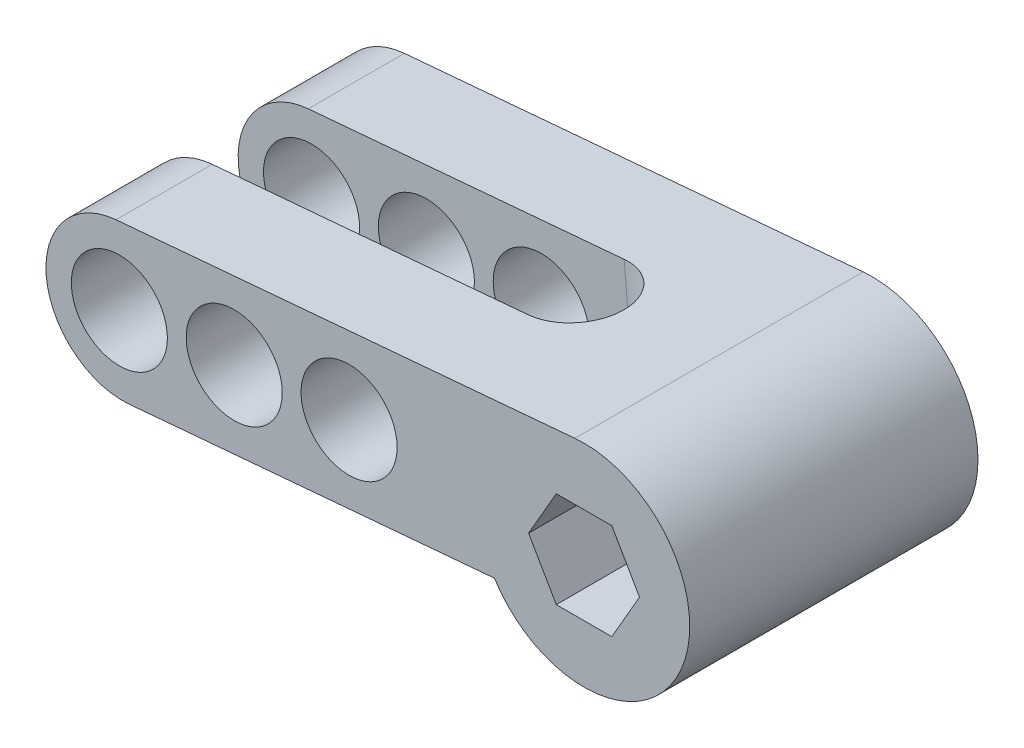
ISO-10303-21;
HEADER;
FILE_DESCRIPTION(('STEP AP214'),'2;1');
FILE_NAME('part.step','',(''),(''),'','','');
FILE_SCHEMA(('AUTOMOTIVE_DESIGN { 1 0 10303 214 1 1 1 1 }'));
ENDSEC;
DATA;
#1=APPLICATION_CONTEXT('core data for automotive mechanical design processes');
#2=APPLICATION_PROTOCOL_DEFINITION('international standard','automotive_design',2000,#1);
#3=PRODUCT_CONTEXT('',#1,'mechanical');
#4=PRODUCT('Part','Part','',(#3));
#5=PRODUCT_RELATED_PRODUCT_CATEGORY('part','',(#4));
#6=PRODUCT_DEFINITION_FORMATION('','',#4);
#7=PRODUCT_DEFINITION_CONTEXT('part definition',#1,'design');
#8=PRODUCT_DEFINITION('design','',#6,#7);
#9=PRODUCT_DEFINITION_SHAPE('','',#8);
#10=(LENGTH_UNIT() NAMED_UNIT(*) SI_UNIT(.MILLI.,.METRE.));
#11=(NAMED_UNIT(*) PLANE_ANGLE_UNIT() SI_UNIT($,.RADIAN.));
#12=(NAMED_UNIT(*) SI_UNIT($,.STERADIAN.) SOLID_ANGLE_UNIT());
#13=UNCERTAINTY_MEASURE_WITH_UNIT(LENGTH_MEASURE(1.E-05),#10,'distance_accuracy_value','');
#14=(GEOMETRIC_REPRESENTATION_CONTEXT(3) GLOBAL_UNCERTAINTY_ASSIGNED_CONTEXT((#13)) GLOBAL_UNIT_ASSIGNED_CONTEXT((#10,
#11,#12)) REPRESENTATION_CONTEXT('',''));
#15=CARTESIAN_POINT('',(0.,0.,0.));
#16=DIRECTION('',(0.,0.,1.));
#17=DIRECTION('',(1.,0.,0.));
#18=AXIS2_PLACEMENT_3D('',#15,#16,#17);
#19=CARTESIAN_POINT('',(-23.8813367654225,-0.985663432292144,30.));
#20=DIRECTION('',(0.,0.,-1.));
#21=DIRECTION('',(-1.,0.,0.));
#22=AXIS2_PLACEMENT_3D('',#19,#20,#21);
#23=CYLINDRICAL_SURFACE('',#22,8.00000000000002);
#24=DIRECTION('',(0.,0.,-1.));
#25=VECTOR('',#24,1.);
#26=CARTESIAN_POINT('',(-23.1840908234413,-8.95522101702613,30.));
#27=LINE('',#26,#25);
#28=CARTESIAN_POINT('',(-23.1840908234413,-8.95522101702612,10.));
#29=VERTEX_POINT('',#28);
#30=CARTESIAN_POINT('',(-23.1840908234413,-8.95522101702613,0.));
#31=VERTEX_POINT('',#30);
#32=EDGE_CURVE('E232',#29,#31,#27,.T.);
#33=ORIENTED_EDGE('',*,*,#32,.F.);
#34=CARTESIAN_POINT('',(-23.8813367654225,-0.985663432292144,10.));
#35=DIRECTION('',(0.,0.,-1.));
#36=DIRECTION('',(-1.,0.,0.));
#37=AXIS2_PLACEMENT_3D('',#34,#35,#36);
#38=CIRCLE('',#37,8.00000000000002);
#39=CARTESIAN_POINT('',(-24.5785827074038,6.98389415244186,10.));
#40=VERTEX_POINT('',#39);
#41=EDGE_CURVE('E163',#29,#40,#38,.T.);
#42=ORIENTED_EDGE('',*,*,#41,.T.);
#43=DIRECTION('',(0.,0.,-1.));
#44=VECTOR('',#43,1.);
#45=CARTESIAN_POINT('',(-24.5785827074038,6.98389415244185,30.));
#46=LINE('',#45,#44);
#47=CARTESIAN_POINT('',(-24.5785827074038,6.98389415244185,0.));
#48=VERTEX_POINT('',#47);
#49=EDGE_CURVE('E236',#40,#48,#46,.T.);
#50=ORIENTED_EDGE('',*,*,#49,.T.);
#51=CARTESIAN_POINT('',(-23.8813367654225,-0.985663432292144,0.));
#52=DIRECTION('',(0.,0.,1.));
#53=DIRECTION('',(1.,0.,0.));
#54=AXIS2_PLACEMENT_3D('',#51,#52,#53);
#55=CIRCLE('',#54,8.00000000000002);
#56=EDGE_CURVE('E226',#48,#31,#55,.T.);
#57=ORIENTED_EDGE('',*,*,#56,.T.);
#58=EDGE_LOOP('',(#33,#42,#50,#57));
#59=FACE_BOUND('',#58,.T.);
#60=ADVANCED_FACE('F33',(#59),#23,.T.);
#61=CARTESIAN_POINT('',(24.1186632345775,0.202332904322172,30.));
#62=DIRECTION('',(0.,0.,1.));
#63=DIRECTION('',(1.,0.,0.));
#64=AXIS2_PLACEMENT_3D('',#61,#62,#63);
#65=PLANE('',#64);
#66=CARTESIAN_POINT('',(-0.334853870139772,1.07438688695221,30.));
#67=DIRECTION('',(0.,0.,1.));
#68=DIRECTION('',(1.,0.,0.));
#69=AXIS2_PLACEMENT_3D('',#66,#67,#68);
#70=CIRCLE('',#69,5.);
#71=CARTESIAN_POINT('',(4.66514612986023,1.07438688695221,30.));
#72=VERTEX_POINT('',#71);
#73=EDGE_CURVE('E373',#72,#72,#70,.T.);
#74=ORIENTED_EDGE('',*,*,#73,.F.);
#75=EDGE_LOOP('',(#74));
#76=FACE_BOUND('',#75,.T.);
#77=CARTESIAN_POINT('',(-12.2891902472407,0.0285179739803122,30.));
#78=DIRECTION('',(0.,0.,1.));
#79=DIRECTION('',(1.,0.,0.));
#80=AXIS2_PLACEMENT_3D('',#77,#78,#79);
#81=CIRCLE('',#80,5.);
#82=CARTESIAN_POINT('',(-7.28919024724072,0.0285179739803122,30.));
#83=VERTEX_POINT('',#82);
#84=EDGE_CURVE('E258',#83,#83,#81,.T.);
#85=ORIENTED_EDGE('',*,*,#84,.F.);
#86=EDGE_LOOP('',(#85));
#87=FACE_BOUND('',#86,.T.);
#88=CARTESIAN_POINT('',(-24.2435266243417,-1.01735093899159,30.));
#89=DIRECTION('',(0.,0.,1.));
#90=DIRECTION('',(1.,0.,0.));
#91=AXIS2_PLACEMENT_3D('',#88,#89,#90);
#92=CIRCLE('',#91,5.);
#93=CARTESIAN_POINT('',(-19.2435266243417,-1.01735093899159,30.));
#94=VERTEX_POINT('',#93);
#95=EDGE_CURVE('E255',#94,#94,#92,.T.);
#96=ORIENTED_EDGE('',*,*,#95,.F.);
#97=EDGE_LOOP('',(#96));
#98=FACE_BOUND('',#97,.T.);
#99=CARTESIAN_POINT('',(24.1186632345775,0.202332904322172,30.));
#100=DIRECTION('',(0.,0.,1.));
#101=DIRECTION('',(1.,0.,0.));
#102=AXIS2_PLACEMENT_3D('',#99,#100,#101);
#103=CIRCLE('',#102,11.);
#104=CARTESIAN_POINT('',(14.7937671691529,-5.6325889776767,30.));
#105=VERTEX_POINT('',#104);
#106=CARTESIAN_POINT('',(23.1599500643533,11.1604745833314,30.));
#107=VERTEX_POINT('',#106);
#108=EDGE_CURVE('E210',#105,#107,#103,.T.);
#109=ORIENTED_EDGE('',*,*,#108,.T.);
#110=DIRECTION('',(-0.996194698091746,-0.0871557427476584,0.));
#111=VECTOR('',#110,1.);
#112=CARTESIAN_POINT('',(23.1599500643533,11.1604745833314,30.));
#113=LINE('',#112,#111);
#114=CARTESIAN_POINT('',(-24.5785827074038,6.98389415244185,30.));
#115=VERTEX_POINT('',#114);
#116=EDGE_CURVE('E213',#107,#115,#113,.T.);
#117=ORIENTED_EDGE('',*,*,#116,.T.);
#118=CARTESIAN_POINT('',(-23.8813367654225,-0.985663432292144,30.));
#119=DIRECTION('',(0.,0.,1.));
#120=DIRECTION('',(1.,0.,0.));
#121=AXIS2_PLACEMENT_3D('',#118,#119,#120);
#122=CIRCLE('',#121,8.00000000000002);
#123=CARTESIAN_POINT('',(-23.1840908234413,-8.95522101702613,30.));
#124=VERTEX_POINT('',#123);
#125=EDGE_CURVE('E216',#115,#124,#122,.T.);
#126=ORIENTED_EDGE('',*,*,#125,.T.);
#127=DIRECTION('',(0.996194698091746,0.0871557427476587,0.));
#128=VECTOR('',#127,1.);
#129=CARTESIAN_POINT('',(-23.1840908234412,-8.95522101702612,30.));
#130=LINE('',#129,#128);
#131=EDGE_CURVE('E218',#124,#105,#130,.T.);
#132=ORIENTED_EDGE('',*,*,#131,.T.);
#133=EDGE_LOOP('',(#109,#117,#126,#132));
#134=FACE_BOUND('',#133,.T.);
#135=DIRECTION('',(0.500000000000001,0.866025403784438,0.));
#136=VECTOR('',#135,1.);
#137=CARTESIAN_POINT('',(27.0054145805257,-4.79766709567789,30.));
#138=LINE('',#137,#136);
#139=CARTESIAN_POINT('',(27.0054145805257,-4.79766709567789,30.));
#140=VERTEX_POINT('',#139);
#141=CARTESIAN_POINT('',(29.8921659264738,0.202332904322144,30.));
#142=VERTEX_POINT('',#141);
#143=EDGE_CURVE('E169',#140,#142,#138,.T.);
#144=ORIENTED_EDGE('',*,*,#143,.F.);
#145=DIRECTION('',(1.,0.,0.));
#146=VECTOR('',#145,1.);
#147=CARTESIAN_POINT('',(21.2319118886294,-4.79766709567789,30.));
#148=LINE('',#147,#146);
#149=CARTESIAN_POINT('',(21.2319118886294,-4.79766709567789,30.));
#150=VERTEX_POINT('',#149);
#151=EDGE_CURVE('E167',#150,#140,#148,.T.);
#152=ORIENTED_EDGE('',*,*,#151,.F.);
#153=DIRECTION('',(0.500000000000001,-0.866025403784438,0.));
#154=VECTOR('',#153,1.);
#155=CARTESIAN_POINT('',(18.3451605426812,0.202332904322144,30.));
#156=LINE('',#155,#154);
#157=CARTESIAN_POINT('',(18.3451605426812,0.202332904322145,30.));
#158=VERTEX_POINT('',#157);
#159=EDGE_CURVE('E178',#158,#150,#156,.T.);
#160=ORIENTED_EDGE('',*,*,#159,.F.);
#161=DIRECTION('',(-0.499999999999999,-0.866025403784439,0.));
#162=VECTOR('',#161,1.);
#163=CARTESIAN_POINT('',(21.2319118886294,5.2023329043222,30.));
#164=LINE('',#163,#162);
#165=CARTESIAN_POINT('',(21.2319118886294,5.2023329043222,30.));
#166=VERTEX_POINT('',#165);
#167=EDGE_CURVE('E176',#166,#158,#164,.T.);
#168=ORIENTED_EDGE('',*,*,#167,.F.);
#169=DIRECTION('',(-1.,0.,0.));
#170=VECTOR('',#169,1.);
#171=CARTESIAN_POINT('',(27.0054145805257,5.2023329043222,30.));
#172=LINE('',#171,#170);
#173=CARTESIAN_POINT('',(27.0054145805257,5.2023329043222,30.));
#174=VERTEX_POINT('',#173);
#175=EDGE_CURVE('E174',#174,#166,#172,.T.);
#176=ORIENTED_EDGE('',*,*,#175,.F.);
#177=DIRECTION('',(-0.5,0.866025403784438,0.));
#178=VECTOR('',#177,1.);
#179=CARTESIAN_POINT('',(29.8921659264738,0.202332904322144,30.));
#180=LINE('',#179,#178);
#181=EDGE_CURVE('E172',#142,#174,#180,.T.);
#182=ORIENTED_EDGE('',*,*,#181,.F.);
#183=EDGE_LOOP('',(#144,#152,#160,#168,#176,#182));
#184=FACE_BOUND('',#183,.T.);
#185=ADVANCED_FACE('F294',(#76,#87,#98,#134,#184),#65,.T.);
#186=CARTESIAN_POINT('',(24.1186632345775,0.202332904322172,0.));
#187=DIRECTION('',(0.,0.,1.));
#188=DIRECTION('',(1.,0.,0.));
#189=AXIS2_PLACEMENT_3D('',#186,#187,#188);
#190=PLANE('',#189);
#191=CARTESIAN_POINT('',(-0.334853870139772,1.07438688695221,0.));
#192=DIRECTION('',(0.,0.,1.));
#193=DIRECTION('',(1.,0.,0.));
#194=AXIS2_PLACEMENT_3D('',#191,#192,#193);
#195=CIRCLE('',#194,5.);
#196=CARTESIAN_POINT('',(4.66514612986023,1.07438688695221,0.));
#197=VERTEX_POINT('',#196);
#198=EDGE_CURVE('E370',#197,#197,#195,.T.);
#199=ORIENTED_EDGE('',*,*,#198,.T.);
#200=EDGE_LOOP('',(#199));
#201=FACE_BOUND('',#200,.T.);
#202=CARTESIAN_POINT('',(-12.2891902472407,0.0285179739803122,0.));
#203=DIRECTION('',(0.,0.,1.));
#204=DIRECTION('',(1.,0.,0.));
#205=AXIS2_PLACEMENT_3D('',#202,#203,#204);
#206=CIRCLE('',#205,5.);
#207=CARTESIAN_POINT('',(-7.28919024724072,0.0285179739803122,0.));
#208=VERTEX_POINT('',#207);
#209=EDGE_CURVE('E251',#208,#208,#206,.T.);
#210=ORIENTED_EDGE('',*,*,#209,.T.);
#211=EDGE_LOOP('',(#210));
#212=FACE_BOUND('',#211,.T.);
#213=CARTESIAN_POINT('',(-24.2435266243417,-1.01735093899159,0.));
#214=DIRECTION('',(0.,0.,1.));
#215=DIRECTION('',(1.,0.,0.));
#216=AXIS2_PLACEMENT_3D('',#213,#214,#215);
#217=CIRCLE('',#216,5.);
#218=CARTESIAN_POINT('',(-19.2435266243417,-1.01735093899159,0.));
#219=VERTEX_POINT('',#218);
#220=EDGE_CURVE('E247',#219,#219,#217,.T.);
#221=ORIENTED_EDGE('',*,*,#220,.T.);
#222=EDGE_LOOP('',(#221));
#223=FACE_BOUND('',#222,.T.);
#224=CARTESIAN_POINT('',(24.1186632345775,0.202332904322172,0.));
#225=DIRECTION('',(0.,0.,1.));
#226=DIRECTION('',(1.,0.,0.));
#227=AXIS2_PLACEMENT_3D('',#224,#225,#226);
#228=CIRCLE('',#227,11.);
#229=CARTESIAN_POINT('',(14.7937671691529,-5.6325889776767,0.));
#230=VERTEX_POINT('',#229);
#231=CARTESIAN_POINT('',(23.1599500643533,11.1604745833314,0.));
#232=VERTEX_POINT('',#231);
#233=EDGE_CURVE('E209',#230,#232,#228,.T.);
#234=ORIENTED_EDGE('',*,*,#233,.F.);
#235=DIRECTION('',(0.996194698091746,0.0871557427476587,0.));
#236=VECTOR('',#235,1.);
#237=CARTESIAN_POINT('',(-23.1840908234412,-8.95522101702612,0.));
#238=LINE('',#237,#236);
#239=EDGE_CURVE('E214',#31,#230,#238,.T.);
#240=ORIENTED_EDGE('',*,*,#239,.F.);
#241=ORIENTED_EDGE('',*,*,#56,.F.);
#242=DIRECTION('',(-0.996194698091746,-0.0871557427476584,0.));
#243=VECTOR('',#242,1.);
#244=CARTESIAN_POINT('',(23.1599500643533,11.1604745833314,0.));
#245=LINE('',#244,#243);
#246=EDGE_CURVE('E223',#232,#48,#245,.T.);
#247=ORIENTED_EDGE('',*,*,#246,.F.);
#248=EDGE_LOOP('',(#234,#240,#241,#247));
#249=FACE_BOUND('',#248,.T.);
#250=DIRECTION('',(1.,0.,0.));
#251=VECTOR('',#250,1.);
#252=CARTESIAN_POINT('',(21.2319118886294,-4.79766709567789,0.));
#253=LINE('',#252,#251);
#254=CARTESIAN_POINT('',(21.2319118886294,-4.79766709567789,0.));
#255=VERTEX_POINT('',#254);
#256=CARTESIAN_POINT('',(27.0054145805257,-4.79766709567789,0.));
#257=VERTEX_POINT('',#256);
#258=EDGE_CURVE('E166',#255,#257,#253,.T.);
#259=ORIENTED_EDGE('',*,*,#258,.T.);
#260=DIRECTION('',(0.500000000000001,0.866025403784438,0.));
#261=VECTOR('',#260,1.);
#262=CARTESIAN_POINT('',(27.0054145805257,-4.79766709567789,0.));
#263=LINE('',#262,#261);
#264=CARTESIAN_POINT('',(29.8921659264738,0.202332904322144,0.));
#265=VERTEX_POINT('',#264);
#266=EDGE_CURVE('E183',#257,#265,#263,.T.);
#267=ORIENTED_EDGE('',*,*,#266,.T.);
#268=DIRECTION('',(-0.5,0.866025403784438,0.));
#269=VECTOR('',#268,1.);
#270=CARTESIAN_POINT('',(29.8921659264738,0.202332904322144,0.));
#271=LINE('',#270,#269);
#272=CARTESIAN_POINT('',(27.0054145805257,5.2023329043222,0.));
#273=VERTEX_POINT('',#272);
#274=EDGE_CURVE('E186',#265,#273,#271,.T.);
#275=ORIENTED_EDGE('',*,*,#274,.T.);
#276=DIRECTION('',(-1.,0.,0.));
#277=VECTOR('',#276,1.);
#278=CARTESIAN_POINT('',(27.0054145805257,5.2023329043222,0.));
#279=LINE('',#278,#277);
#280=CARTESIAN_POINT('',(21.2319118886294,5.2023329043222,0.));
#281=VERTEX_POINT('',#280);
#282=EDGE_CURVE('E189',#273,#281,#279,.T.);
#283=ORIENTED_EDGE('',*,*,#282,.T.);
#284=DIRECTION('',(-0.499999999999999,-0.866025403784439,0.));
#285=VECTOR('',#284,1.);
#286=CARTESIAN_POINT('',(21.2319118886294,5.2023329043222,0.));
#287=LINE('',#286,#285);
#288=CARTESIAN_POINT('',(18.3451605426812,0.202332904322144,0.));
#289=VERTEX_POINT('',#288);
#290=EDGE_CURVE('E192',#281,#289,#287,.T.);
#291=ORIENTED_EDGE('',*,*,#290,.T.);
#292=DIRECTION('',(0.500000000000001,-0.866025403784438,0.));
#293=VECTOR('',#292,1.);
#294=CARTESIAN_POINT('',(18.3451605426812,0.202332904322144,0.));
#295=LINE('',#294,#293);
#296=EDGE_CURVE('E170',#289,#255,#295,.T.);
#297=ORIENTED_EDGE('',*,*,#296,.T.);
#298=EDGE_LOOP('',(#259,#267,#275,#283,#291,#297));
#299=FACE_BOUND('',#298,.T.);
#300=ADVANCED_FACE('F301',(#201,#212,#223,#249,#299),#190,.F.);
#301=CARTESIAN_POINT('',(24.1186632345775,0.202332904322172,30.));
#302=DIRECTION('',(0.,0.,-1.));
#303=DIRECTION('',(-1.,0.,0.));
#304=AXIS2_PLACEMENT_3D('',#301,#302,#303);
#305=CYLINDRICAL_SURFACE('',#304,11.);
#306=ORIENTED_EDGE('',*,*,#233,.T.);
#307=DIRECTION('',(0.,0.,-1.));
#308=VECTOR('',#307,1.);
#309=CARTESIAN_POINT('',(23.1599500643533,11.1604745833314,30.));
#310=LINE('',#309,#308);
#311=EDGE_CURVE('E239',#107,#232,#310,.T.);
#312=ORIENTED_EDGE('',*,*,#311,.F.);
#313=ORIENTED_EDGE('',*,*,#108,.F.);
#314=DIRECTION('',(0.,0.,-1.));
#315=VECTOR('',#314,1.);
#316=CARTESIAN_POINT('',(14.7937671691529,-5.6325889776767,30.));
#317=LINE('',#316,#315);
#318=EDGE_CURVE('E220',#105,#230,#317,.T.);
#319=ORIENTED_EDGE('',*,*,#318,.T.);
#320=EDGE_LOOP('',(#306,#312,#313,#319));
#321=FACE_BOUND('',#320,.T.);
#322=ADVANCED_FACE('F35',(#321),#305,.T.);
#323=CARTESIAN_POINT('',(23.1599500643533,11.1604745833314,30.));
#324=DIRECTION('',(0.0871557427476584,-0.996194698091746,0.));
#325=DIRECTION('',(0.996194698091746,0.0871557427476584,0.));
#326=AXIS2_PLACEMENT_3D('',#323,#324,#325);
#327=PLANE('',#326);
#328=ORIENTED_EDGE('',*,*,#49,.F.);
#329=DIRECTION('',(-0.996194698091746,-0.0871557427476585,0.));
#330=VECTOR('',#329,1.);
#331=CARTESIAN_POINT('',(-33.5491442708531,6.19907171017865,10.));
#332=LINE('',#331,#330);
#333=CARTESIAN_POINT('',(8.29103304900021,9.85961290558031,10.));
#334=VERTEX_POINT('',#333);
#335=EDGE_CURVE('E143',#334,#40,#332,.T.);
#336=ORIENTED_EDGE('',*,*,#335,.F.);
#337=CARTESIAN_POINT('',(8.29103304900021,9.85961290558031,15.));
#338=DIRECTION('',(-0.0871557427476584,0.996194698091746,0.));
#339=DIRECTION('',(-0.996194698091746,-0.0871557427476584,0.));
#340=AXIS2_PLACEMENT_3D('',#337,#338,#339);
#341=CIRCLE('',#340,5.);
#342=CARTESIAN_POINT('',(8.29103304900021,9.85961290558031,20.));
#343=VERTEX_POINT('',#342);
#344=EDGE_CURVE('E138',#343,#334,#341,.T.);
#345=ORIENTED_EDGE('',*,*,#344,.F.);
#346=DIRECTION('',(0.996194698091746,0.0871557427476585,0.));
#347=VECTOR('',#346,1.);
#348=CARTESIAN_POINT('',(-33.5491442708531,6.19907171017865,20.));
#349=LINE('',#348,#347);
#350=CARTESIAN_POINT('',(-24.5785827074038,6.98389415244186,20.));
#351=VERTEX_POINT('',#350);
#352=EDGE_CURVE('E146',#351,#343,#349,.T.);
#353=ORIENTED_EDGE('',*,*,#352,.F.);
#354=EDGE_CURVE('E237',#115,#351,#46,.T.);
#355=ORIENTED_EDGE('',*,*,#354,.F.);
#356=ORIENTED_EDGE('',*,*,#116,.F.);
#357=ORIENTED_EDGE('',*,*,#311,.T.);
#358=ORIENTED_EDGE('',*,*,#246,.T.);
#359=EDGE_LOOP('',(#328,#336,#345,#353,#355,#356,#357,#358));
#360=FACE_BOUND('',#359,.T.);
#361=ADVANCED_FACE('F156',(#360),#327,.F.);
#362=ORIENTED_EDGE('',*,*,#354,.T.);
#363=CARTESIAN_POINT('',(-23.8813367654225,-0.985663432292144,20.));
#364=DIRECTION('',(0.,0.,1.));
#365=DIRECTION('',(1.,0.,0.));
#366=AXIS2_PLACEMENT_3D('',#363,#364,#365);
#367=CIRCLE('',#366,8.00000000000002);
#368=CARTESIAN_POINT('',(-23.1840908234413,-8.95522101702612,20.));
#369=VERTEX_POINT('',#368);
#370=EDGE_CURVE('E149',#351,#369,#367,.T.);
#371=ORIENTED_EDGE('',*,*,#370,.T.);
#372=EDGE_CURVE('E233',#124,#369,#27,.T.);
#373=ORIENTED_EDGE('',*,*,#372,.F.);
#374=ORIENTED_EDGE('',*,*,#125,.F.);
#375=EDGE_LOOP('',(#362,#371,#373,#374));
#376=FACE_BOUND('',#375,.T.);
#377=ADVANCED_FACE('F297',(#376),#23,.T.);
#378=CARTESIAN_POINT('',(-23.1840908234412,-8.95522101702612,30.));
#379=DIRECTION('',(-0.0871557427476587,0.996194698091745,0.));
#380=DIRECTION('',(-0.996194698091746,-0.0871557427476587,0.));
#381=AXIS2_PLACEMENT_3D('',#378,#379,#380);
#382=PLANE('',#381);
#383=CARTESIAN_POINT('',(9.68552493296274,-6.07950226388766,15.));
#384=DIRECTION('',(-0.0871557427476587,0.996194698091745,0.));
#385=DIRECTION('',(-0.996194698091746,-0.0871557427476587,0.));
#386=AXIS2_PLACEMENT_3D('',#383,#384,#385);
#387=CIRCLE('',#386,5.);
#388=CARTESIAN_POINT('',(9.68552493296274,-6.07950226388766,20.));
#389=VERTEX_POINT('',#388);
#390=CARTESIAN_POINT('',(9.68552493296274,-6.07950226388766,10.));
#391=VERTEX_POINT('',#390);
#392=EDGE_CURVE('E42',#389,#391,#387,.T.);
#393=ORIENTED_EDGE('',*,*,#392,.T.);
#394=DIRECTION('',(-0.996194698091746,-0.0871557427476587,0.));
#395=VECTOR('',#394,1.);
#396=CARTESIAN_POINT('',(-23.1840908234412,-8.95522101702612,10.));
#397=LINE('',#396,#395);
#398=EDGE_CURVE('E11',#391,#29,#397,.T.);
#399=ORIENTED_EDGE('',*,*,#398,.T.);
#400=ORIENTED_EDGE('',*,*,#32,.T.);
#401=ORIENTED_EDGE('',*,*,#239,.T.);
#402=ORIENTED_EDGE('',*,*,#318,.F.);
#403=ORIENTED_EDGE('',*,*,#131,.F.);
#404=ORIENTED_EDGE('',*,*,#372,.T.);
#405=DIRECTION('',(0.996194698091746,0.0871557427476587,0.));
#406=VECTOR('',#405,1.);
#407=CARTESIAN_POINT('',(-23.1840908234412,-8.95522101702612,20.));
#408=LINE('',#407,#406);
#409=EDGE_CURVE('E242',#369,#389,#408,.T.);
#410=ORIENTED_EDGE('',*,*,#409,.T.);
#411=EDGE_LOOP('',(#393,#399,#400,#401,#402,#403,#404,#410));
#412=FACE_BOUND('',#411,.T.);
#413=ADVANCED_FACE('F307',(#412),#382,.F.);
#414=CARTESIAN_POINT('',(21.2319118886294,-4.79766709567789,30.));
#415=DIRECTION('',(0.,1.,0.));
#416=DIRECTION('',(0.,0.,1.));
#417=AXIS2_PLACEMENT_3D('',#414,#415,#416);
#418=PLANE('',#417);
#419=ORIENTED_EDGE('',*,*,#258,.F.);
#420=DIRECTION('',(0.,0.,-1.));
#421=VECTOR('',#420,1.);
#422=CARTESIAN_POINT('',(21.2319118886294,-4.79766709567789,30.));
#423=LINE('',#422,#421);
#424=EDGE_CURVE('E180',#150,#255,#423,.T.);
#425=ORIENTED_EDGE('',*,*,#424,.F.);
#426=ORIENTED_EDGE('',*,*,#151,.T.);
#427=DIRECTION('',(0.,0.,-1.));
#428=VECTOR('',#427,1.);
#429=CARTESIAN_POINT('',(27.0054145805257,-4.79766709567789,30.));
#430=LINE('',#429,#428);
#431=EDGE_CURVE('E206',#140,#257,#430,.T.);
#432=ORIENTED_EDGE('',*,*,#431,.T.);
#433=EDGE_LOOP('',(#419,#425,#426,#432));
#434=FACE_BOUND('',#433,.T.);
#435=ADVANCED_FACE('F313',(#434),#418,.T.);
#436=CARTESIAN_POINT('',(27.0054145805257,-4.79766709567789,30.));
#437=DIRECTION('',(-0.866025403784438,0.500000000000001,0.));
#438=DIRECTION('',(-0.500000000000001,-0.866025403784438,0.));
#439=AXIS2_PLACEMENT_3D('',#436,#437,#438);
#440=PLANE('',#439);
#441=ORIENTED_EDGE('',*,*,#266,.F.);
#442=ORIENTED_EDGE('',*,*,#431,.F.);
#443=ORIENTED_EDGE('',*,*,#143,.T.);
#444=DIRECTION('',(0.,0.,-1.));
#445=VECTOR('',#444,1.);
#446=CARTESIAN_POINT('',(29.8921659264738,0.202332904322144,30.));
#447=LINE('',#446,#445);
#448=EDGE_CURVE('E204',#142,#265,#447,.T.);
#449=ORIENTED_EDGE('',*,*,#448,.T.);
#450=EDGE_LOOP('',(#441,#442,#443,#449));
#451=FACE_BOUND('',#450,.T.);
#452=ADVANCED_FACE('F355',(#451),#440,.T.);
#453=CARTESIAN_POINT('',(29.8921659264738,0.202332904322144,30.));
#454=DIRECTION('',(-0.866025403784438,-0.5,0.));
#455=DIRECTION('',(0.5,-0.866025403784438,0.));
#456=AXIS2_PLACEMENT_3D('',#453,#454,#455);
#457=PLANE('',#456);
#458=ORIENTED_EDGE('',*,*,#274,.F.);
#459=ORIENTED_EDGE('',*,*,#448,.F.);
#460=ORIENTED_EDGE('',*,*,#181,.T.);
#461=DIRECTION('',(0.,0.,-1.));
#462=VECTOR('',#461,1.);
#463=CARTESIAN_POINT('',(27.0054145805257,5.2023329043222,30.));
#464=LINE('',#463,#462);
#465=EDGE_CURVE('E202',#174,#273,#464,.T.);
#466=ORIENTED_EDGE('',*,*,#465,.T.);
#467=EDGE_LOOP('',(#458,#459,#460,#466));
#468=FACE_BOUND('',#467,.T.);
#469=ADVANCED_FACE('F351',(#468),#457,.T.);
#470=CARTESIAN_POINT('',(27.0054145805257,5.2023329043222,30.));
#471=DIRECTION('',(0.,-1.,0.));
#472=DIRECTION('',(0.,0.,-1.));
#473=AXIS2_PLACEMENT_3D('',#470,#471,#472);
#474=PLANE('',#473);
#475=ORIENTED_EDGE('',*,*,#282,.F.);
#476=ORIENTED_EDGE('',*,*,#465,.F.);
#477=ORIENTED_EDGE('',*,*,#175,.T.);
#478=DIRECTION('',(0.,0.,-1.));
#479=VECTOR('',#478,1.);
#480=CARTESIAN_POINT('',(21.2319118886294,5.2023329043222,30.));
#481=LINE('',#480,#479);
#482=EDGE_CURVE('E200',#166,#281,#481,.T.);
#483=ORIENTED_EDGE('',*,*,#482,.T.);
#484=EDGE_LOOP('',(#475,#476,#477,#483));
#485=FACE_BOUND('',#484,.T.);
#486=ADVANCED_FACE('F347',(#485),#474,.T.);
#487=CARTESIAN_POINT('',(21.2319118886294,5.2023329043222,30.));
#488=DIRECTION('',(0.866025403784439,-0.499999999999999,0.));
#489=DIRECTION('',(0.499999999999999,0.866025403784439,0.));
#490=AXIS2_PLACEMENT_3D('',#487,#488,#489);
#491=PLANE('',#490);
#492=ORIENTED_EDGE('',*,*,#290,.F.);
#493=ORIENTED_EDGE('',*,*,#482,.F.);
#494=ORIENTED_EDGE('',*,*,#167,.T.);
#495=DIRECTION('',(0.,0.,-1.));
#496=VECTOR('',#495,1.);
#497=CARTESIAN_POINT('',(18.3451605426812,0.202332904322144,30.));
#498=LINE('',#497,#496);
#499=EDGE_CURVE('E58',#158,#289,#498,.T.);
#500=ORIENTED_EDGE('',*,*,#499,.T.);
#501=EDGE_LOOP('',(#492,#493,#494,#500));
#502=FACE_BOUND('',#501,.T.);
#503=ADVANCED_FACE('F337',(#502),#491,.T.);
#504=CARTESIAN_POINT('',(18.3451605426812,0.202332904322144,30.));
#505=DIRECTION('',(0.866025403784438,0.500000000000001,0.));
#506=DIRECTION('',(-0.500000000000001,0.866025403784438,0.));
#507=AXIS2_PLACEMENT_3D('',#504,#505,#506);
#508=PLANE('',#507);
#509=ORIENTED_EDGE('',*,*,#296,.F.);
#510=ORIENTED_EDGE('',*,*,#499,.F.);
#511=ORIENTED_EDGE('',*,*,#159,.T.);
#512=ORIENTED_EDGE('',*,*,#424,.T.);
#513=EDGE_LOOP('',(#509,#510,#511,#512));
#514=FACE_BOUND('',#513,.T.);
#515=ADVANCED_FACE('F330',(#514),#508,.T.);
#516=CARTESIAN_POINT('',(-31.5518087650279,-16.6305775875659,10.));
#517=DIRECTION('',(0.,0.,-1.));
#518=DIRECTION('',(-1.,0.,0.));
#519=AXIS2_PLACEMENT_3D('',#516,#517,#518);
#520=PLANE('',#519);
#521=CARTESIAN_POINT('',(-0.334853870139772,1.07438688695221,10.));
#522=DIRECTION('',(0.,0.,-1.));
#523=DIRECTION('',(-1.,0.,0.));
#524=AXIS2_PLACEMENT_3D('',#521,#522,#523);
#525=CIRCLE('',#524,5.);
#526=CARTESIAN_POINT('',(-5.33485387013977,1.07438688695221,10.));
#527=VERTEX_POINT('',#526);
#528=EDGE_CURVE('E263',#527,#527,#525,.T.);
#529=ORIENTED_EDGE('',*,*,#528,.T.);
#530=EDGE_LOOP('',(#529));
#531=FACE_BOUND('',#530,.T.);
#532=CARTESIAN_POINT('',(-12.2891902472407,0.0285179739803122,10.));
#533=DIRECTION('',(0.,0.,-1.));
#534=DIRECTION('',(-1.,0.,0.));
#535=AXIS2_PLACEMENT_3D('',#532,#533,#534);
#536=CIRCLE('',#535,5.);
#537=CARTESIAN_POINT('',(-17.2891902472407,0.0285179739803122,10.));
#538=VERTEX_POINT('',#537);
#539=EDGE_CURVE('E250',#538,#538,#536,.T.);
#540=ORIENTED_EDGE('',*,*,#539,.T.);
#541=EDGE_LOOP('',(#540));
#542=FACE_BOUND('',#541,.T.);
#543=CARTESIAN_POINT('',(-24.2435266243417,-1.01735093899159,10.));
#544=DIRECTION('',(0.,0.,-1.));
#545=DIRECTION('',(-1.,0.,0.));
#546=AXIS2_PLACEMENT_3D('',#543,#544,#545);
#547=CIRCLE('',#546,5.);
#548=CARTESIAN_POINT('',(-29.2435266243417,-1.01735093899159,10.));
#549=VERTEX_POINT('',#548);
#550=EDGE_CURVE('E153',#549,#549,#547,.T.);
#551=ORIENTED_EDGE('',*,*,#550,.T.);
#552=EDGE_LOOP('',(#551));
#553=FACE_BOUND('',#552,.T.);
#554=ORIENTED_EDGE('',*,*,#398,.F.);
#555=DIRECTION('',(-0.0871557427476584,0.996194698091745,0.));
#556=VECTOR('',#555,1.);
#557=CARTESIAN_POINT('',(10.2883685548254,-12.9700363921642,10.));
#558=LINE('',#557,#556);
#559=EDGE_CURVE('E142',#391,#334,#558,.T.);
#560=ORIENTED_EDGE('',*,*,#559,.T.);
#561=ORIENTED_EDGE('',*,*,#335,.T.);
#562=ORIENTED_EDGE('',*,*,#41,.F.);
#563=EDGE_LOOP('',(#554,#560,#561,#562));
#564=FACE_BOUND('',#563,.T.);
#565=ADVANCED_FACE('F274',(#531,#542,#553,#564),#520,.F.);
#566=CARTESIAN_POINT('',(10.2883685548254,-12.9700363921642,15.));
#567=DIRECTION('',(-0.0871557427476584,0.996194698091745,0.));
#568=DIRECTION('',(-0.996194698091746,-0.0871557427476584,0.));
#569=AXIS2_PLACEMENT_3D('',#566,#567,#568);
#570=CYLINDRICAL_SURFACE('',#569,5.);
#571=DIRECTION('',(-0.0871557427476584,0.996194698091745,0.));
#572=VECTOR('',#571,1.);
#573=CARTESIAN_POINT('',(10.2883685548254,-12.9700363921642,20.));
#574=LINE('',#573,#572);
#575=EDGE_CURVE('E50',#389,#343,#574,.T.);
#576=ORIENTED_EDGE('',*,*,#575,.T.);
#577=ORIENTED_EDGE('',*,*,#344,.T.);
#578=ORIENTED_EDGE('',*,*,#559,.F.);
#579=ORIENTED_EDGE('',*,*,#392,.F.);
#580=EDGE_LOOP('',(#576,#577,#578,#579));
#581=FACE_BOUND('',#580,.T.);
#582=ADVANCED_FACE('F135',(#581),#570,.F.);
#583=CARTESIAN_POINT('',(-31.5518087650279,-16.6305775875659,20.));
#584=DIRECTION('',(0.,0.,1.));
#585=DIRECTION('',(1.,0.,0.));
#586=AXIS2_PLACEMENT_3D('',#583,#584,#585);
#587=PLANE('',#586);
#588=CARTESIAN_POINT('',(-0.334853870139772,1.07438688695221,20.));
#589=DIRECTION('',(0.,0.,1.));
#590=DIRECTION('',(1.,0.,0.));
#591=AXIS2_PLACEMENT_3D('',#588,#589,#590);
#592=CIRCLE('',#591,5.);
#593=CARTESIAN_POINT('',(4.66514612986023,1.07438688695221,20.));
#594=VERTEX_POINT('',#593);
#595=EDGE_CURVE('E37',#594,#594,#592,.T.);
#596=ORIENTED_EDGE('',*,*,#595,.T.);
#597=EDGE_LOOP('',(#596));
#598=FACE_BOUND('',#597,.T.);
#599=CARTESIAN_POINT('',(-12.2891902472407,0.0285179739803122,20.));
#600=DIRECTION('',(0.,0.,1.));
#601=DIRECTION('',(1.,0.,0.));
#602=AXIS2_PLACEMENT_3D('',#599,#600,#601);
#603=CIRCLE('',#602,5.);
#604=CARTESIAN_POINT('',(-7.28919024724072,0.0285179739803122,20.));
#605=VERTEX_POINT('',#604);
#606=EDGE_CURVE('E248',#605,#605,#603,.T.);
#607=ORIENTED_EDGE('',*,*,#606,.T.);
#608=EDGE_LOOP('',(#607));
#609=FACE_BOUND('',#608,.T.);
#610=CARTESIAN_POINT('',(-24.2435266243417,-1.01735093899159,20.));
#611=DIRECTION('',(0.,0.,1.));
#612=DIRECTION('',(1.,0.,0.));
#613=AXIS2_PLACEMENT_3D('',#610,#611,#612);
#614=CIRCLE('',#613,5.);
#615=CARTESIAN_POINT('',(-19.2435266243417,-1.01735093899159,20.));
#616=VERTEX_POINT('',#615);
#617=EDGE_CURVE('E245',#616,#616,#614,.T.);
#618=ORIENTED_EDGE('',*,*,#617,.T.);
#619=EDGE_LOOP('',(#618));
#620=FACE_BOUND('',#619,.T.);
#621=ORIENTED_EDGE('',*,*,#352,.T.);
#622=ORIENTED_EDGE('',*,*,#575,.F.);
#623=ORIENTED_EDGE('',*,*,#409,.F.);
#624=ORIENTED_EDGE('',*,*,#370,.F.);
#625=EDGE_LOOP('',(#621,#622,#623,#624));
#626=FACE_BOUND('',#625,.T.);
#627=ADVANCED_FACE('F147',(#598,#609,#620,#626),#587,.F.);
#628=CARTESIAN_POINT('',(-24.2435266243417,-1.01735093899159,0.));
#629=DIRECTION('',(0.,0.,1.));
#630=DIRECTION('',(1.,0.,0.));
#631=AXIS2_PLACEMENT_3D('',#628,#629,#630);
#632=CYLINDRICAL_SURFACE('',#631,5.);
#633=ORIENTED_EDGE('',*,*,#95,.T.);
#634=EDGE_LOOP('',(#633));
#635=FACE_BOUND('',#634,.T.);
#636=ORIENTED_EDGE('',*,*,#617,.F.);
#637=EDGE_LOOP('',(#636));
#638=FACE_BOUND('',#637,.T.);
#639=ADVANCED_FACE('F280',(#635,#638),#632,.F.);
#640=ORIENTED_EDGE('',*,*,#220,.F.);
#641=EDGE_LOOP('',(#640));
#642=FACE_BOUND('',#641,.T.);
#643=ORIENTED_EDGE('',*,*,#550,.F.);
#644=EDGE_LOOP('',(#643));
#645=FACE_BOUND('',#644,.T.);
#646=ADVANCED_FACE('F277',(#642,#645),#632,.F.);
#647=CARTESIAN_POINT('',(-12.2891902472407,0.0285179739803122,0.));
#648=DIRECTION('',(0.,0.,1.));
#649=DIRECTION('',(1.,0.,0.));
#650=AXIS2_PLACEMENT_3D('',#647,#648,#649);
#651=CYLINDRICAL_SURFACE('',#650,5.);
#652=ORIENTED_EDGE('',*,*,#84,.T.);
#653=EDGE_LOOP('',(#652));
#654=FACE_BOUND('',#653,.T.);
#655=ORIENTED_EDGE('',*,*,#606,.F.);
#656=EDGE_LOOP('',(#655));
#657=FACE_BOUND('',#656,.T.);
#658=ADVANCED_FACE('F279',(#654,#657),#651,.F.);
#659=ORIENTED_EDGE('',*,*,#209,.F.);
#660=EDGE_LOOP('',(#659));
#661=FACE_BOUND('',#660,.T.);
#662=ORIENTED_EDGE('',*,*,#539,.F.);
#663=EDGE_LOOP('',(#662));
#664=FACE_BOUND('',#663,.T.);
#665=ADVANCED_FACE('F287',(#661,#664),#651,.F.);
#666=CARTESIAN_POINT('',(-0.334853870139772,1.07438688695221,0.));
#667=DIRECTION('',(0.,0.,1.));
#668=DIRECTION('',(1.,0.,0.));
#669=AXIS2_PLACEMENT_3D('',#666,#667,#668);
#670=CYLINDRICAL_SURFACE('',#669,5.);
#671=ORIENTED_EDGE('',*,*,#73,.T.);
#672=EDGE_LOOP('',(#671));
#673=FACE_BOUND('',#672,.T.);
#674=ORIENTED_EDGE('',*,*,#595,.F.);
#675=EDGE_LOOP('',(#674));
#676=FACE_BOUND('',#675,.T.);
#677=ADVANCED_FACE('F379',(#673,#676),#670,.F.);
#678=ORIENTED_EDGE('',*,*,#198,.F.);
#679=EDGE_LOOP('',(#678));
#680=FACE_BOUND('',#679,.T.);
#681=ORIENTED_EDGE('',*,*,#528,.F.);
#682=EDGE_LOOP('',(#681));
#683=FACE_BOUND('',#682,.T.);
#684=ADVANCED_FACE('F390',(#680,#683),#670,.F.);
#685=CLOSED_SHELL('',(#60,#185,#300,#322,#361,#377,#413,#435,#452,#469,#486,#503,#515,#565,#582,
#627,#639,#646,#658,#665,#677,#684));
#686=MANIFOLD_SOLID_BREP('B2',#685);
#687=ADVANCED_BREP_SHAPE_REPRESENTATION('',(#18,#686),#14);
#688=SHAPE_DEFINITION_REPRESENTATION(#9,#687);
ENDSEC;
END-ISO-10303-21;
